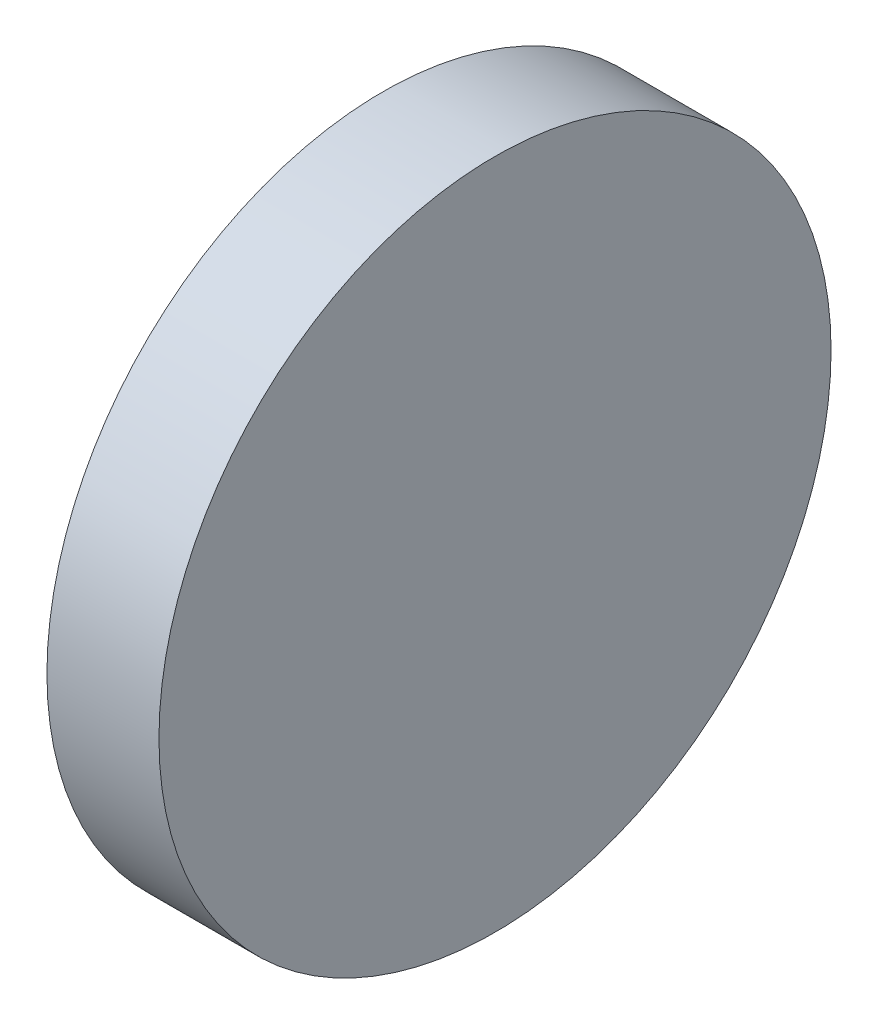
ISO-10303-21;
HEADER;
FILE_DESCRIPTION(('STEP AP214'),'2;1');
FILE_NAME('part.step','',(''),(''),'','','');
FILE_SCHEMA(('AUTOMOTIVE_DESIGN { 1 0 10303 214 1 1 1 1 }'));
ENDSEC;
DATA;
#1=APPLICATION_CONTEXT('core data for automotive mechanical design processes');
#2=APPLICATION_PROTOCOL_DEFINITION('international standard','automotive_design',2000,#1);
#3=PRODUCT_CONTEXT('',#1,'mechanical');
#4=PRODUCT('Part','Part','',(#3));
#5=PRODUCT_RELATED_PRODUCT_CATEGORY('part','',(#4));
#6=PRODUCT_DEFINITION_FORMATION('','',#4);
#7=PRODUCT_DEFINITION_CONTEXT('part definition',#1,'design');
#8=PRODUCT_DEFINITION('design','',#6,#7);
#9=PRODUCT_DEFINITION_SHAPE('','',#8);
#10=(LENGTH_UNIT() NAMED_UNIT(*) SI_UNIT(.MILLI.,.METRE.));
#11=(NAMED_UNIT(*) PLANE_ANGLE_UNIT() SI_UNIT($,.RADIAN.));
#12=(NAMED_UNIT(*) SI_UNIT($,.STERADIAN.) SOLID_ANGLE_UNIT());
#13=UNCERTAINTY_MEASURE_WITH_UNIT(LENGTH_MEASURE(1.E-05),#10,'distance_accuracy_value','');
#14=(GEOMETRIC_REPRESENTATION_CONTEXT(3) GLOBAL_UNCERTAINTY_ASSIGNED_CONTEXT((#13)) GLOBAL_UNIT_ASSIGNED_CONTEXT((#10,
#11,#12)) REPRESENTATION_CONTEXT('',''));
#15=CARTESIAN_POINT('',(0.,0.,0.));
#16=DIRECTION('',(0.,0.,1.));
#17=DIRECTION('',(1.,0.,0.));
#18=AXIS2_PLACEMENT_3D('',#15,#16,#17);
#19=CARTESIAN_POINT('',(0.,0.,0.));
#20=DIRECTION('',(-1.,0.,0.));
#21=DIRECTION('',(0.,0.,1.));
#22=AXIS2_PLACEMENT_3D('',#19,#20,#21);
#23=CYLINDRICAL_SURFACE('',#22,3.);
#24=CARTESIAN_POINT('',(0.,0.,0.));
#25=DIRECTION('',(-1.,0.,0.));
#26=DIRECTION('',(0.,0.,1.));
#27=AXIS2_PLACEMENT_3D('',#24,#25,#26);
#28=CIRCLE('',#27,3.);
#29=CARTESIAN_POINT('',(0.,0.,3.));
#30=VERTEX_POINT('',#29);
#31=EDGE_CURVE('E40',#30,#30,#28,.T.);
#32=ORIENTED_EDGE('',*,*,#31,.F.);
#33=EDGE_LOOP('',(#32));
#34=FACE_BOUND('',#33,.T.);
#35=CARTESIAN_POINT('',(1.,0.,0.));
#36=DIRECTION('',(-1.,0.,0.));
#37=DIRECTION('',(0.,0.,1.));
#38=AXIS2_PLACEMENT_3D('',#35,#36,#37);
#39=CIRCLE('',#38,3.);
#40=CARTESIAN_POINT('',(1.,0.,3.));
#41=VERTEX_POINT('',#40);
#42=EDGE_CURVE('E10',#41,#41,#39,.T.);
#43=ORIENTED_EDGE('',*,*,#42,.T.);
#44=EDGE_LOOP('',(#43));
#45=FACE_BOUND('',#44,.T.);
#46=ADVANCED_FACE('F34',(#34,#45),#23,.T.);
#47=CARTESIAN_POINT('',(1.,3.,0.));
#48=DIRECTION('',(-1.,0.,0.));
#49=DIRECTION('',(0.,0.,1.));
#50=AXIS2_PLACEMENT_3D('',#47,#48,#49);
#51=PLANE('',#50);
#52=ORIENTED_EDGE('',*,*,#42,.F.);
#53=EDGE_LOOP('',(#52));
#54=FACE_BOUND('',#53,.T.);
#55=ADVANCED_FACE('F49',(#54),#51,.F.);
#56=CARTESIAN_POINT('',(0.,3.,0.));
#57=DIRECTION('',(1.,0.,0.));
#58=DIRECTION('',(0.,0.,-1.));
#59=AXIS2_PLACEMENT_3D('',#56,#57,#58);
#60=PLANE('',#59);
#61=ORIENTED_EDGE('',*,*,#31,.T.);
#62=EDGE_LOOP('',(#61));
#63=FACE_BOUND('',#62,.T.);
#64=ADVANCED_FACE('F46',(#63),#60,.F.);
#65=CLOSED_SHELL('',(#46,#55,#64));
#66=MANIFOLD_SOLID_BREP('B2',#65);
#67=ADVANCED_BREP_SHAPE_REPRESENTATION('',(#18,#66),#14);
#68=SHAPE_DEFINITION_REPRESENTATION(#9,#67);
ENDSEC;
END-ISO-10303-21;
